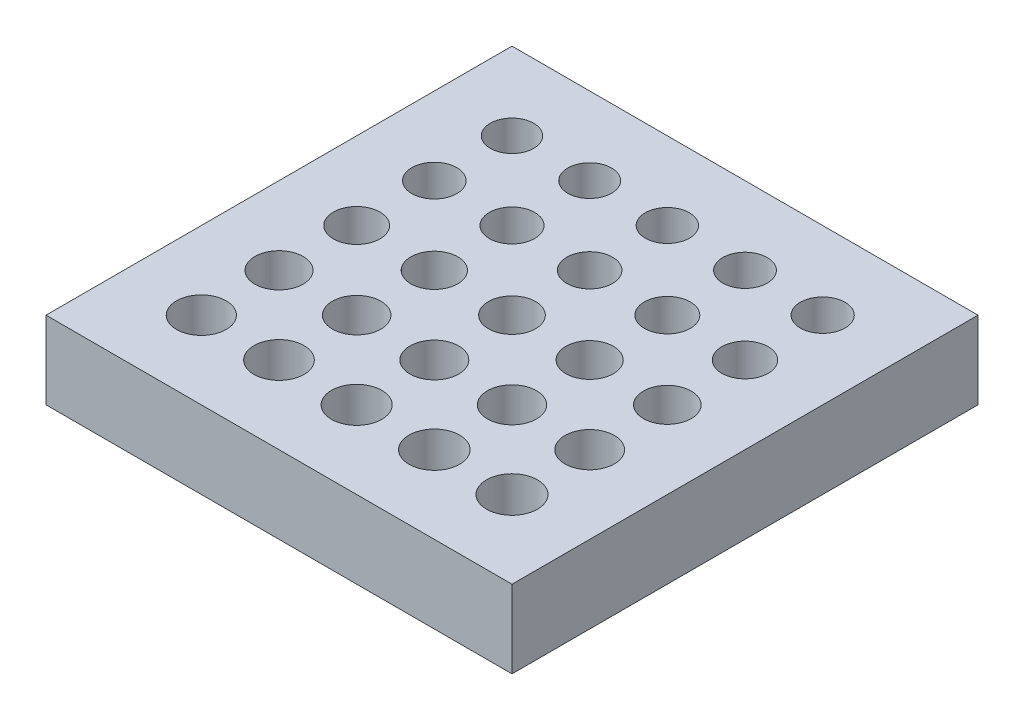
ISO-10303-21;
HEADER;
FILE_DESCRIPTION(('STEP AP214'),'2;1');
FILE_NAME('part.step','',(''),(''),'','','');
FILE_SCHEMA(('AUTOMOTIVE_DESIGN { 1 0 10303 214 1 1 1 1 }'));
ENDSEC;
DATA;
#1=APPLICATION_CONTEXT('core data for automotive mechanical design processes');
#2=APPLICATION_PROTOCOL_DEFINITION('international standard','automotive_design',2000,#1);
#3=PRODUCT_CONTEXT('',#1,'mechanical');
#4=PRODUCT('Part','Part','',(#3));
#5=PRODUCT_RELATED_PRODUCT_CATEGORY('part','',(#4));
#6=PRODUCT_DEFINITION_FORMATION('','',#4);
#7=PRODUCT_DEFINITION_CONTEXT('part definition',#1,'design');
#8=PRODUCT_DEFINITION('design','',#6,#7);
#9=PRODUCT_DEFINITION_SHAPE('','',#8);
#10=(LENGTH_UNIT() NAMED_UNIT(*) SI_UNIT(.MILLI.,.METRE.));
#11=(NAMED_UNIT(*) PLANE_ANGLE_UNIT() SI_UNIT($,.RADIAN.));
#12=(NAMED_UNIT(*) SI_UNIT($,.STERADIAN.) SOLID_ANGLE_UNIT());
#13=UNCERTAINTY_MEASURE_WITH_UNIT(LENGTH_MEASURE(1.E-05),#10,'distance_accuracy_value','');
#14=(GEOMETRIC_REPRESENTATION_CONTEXT(3) GLOBAL_UNCERTAINTY_ASSIGNED_CONTEXT((#13)) GLOBAL_UNIT_ASSIGNED_CONTEXT((#10,
#11,#12)) REPRESENTATION_CONTEXT('',''));
#15=CARTESIAN_POINT('',(0.,0.,0.));
#16=DIRECTION('',(0.,0.,1.));
#17=DIRECTION('',(1.,0.,0.));
#18=AXIS2_PLACEMENT_3D('',#15,#16,#17);
#19=CARTESIAN_POINT('',(0.,6.35,0.));
#20=DIRECTION('',(0.,-1.,0.));
#21=DIRECTION('',(0.,0.,-1.));
#22=AXIS2_PLACEMENT_3D('',#19,#20,#21);
#23=PLANE('',#22);
#24=DIRECTION('',(0.,0.,-1.));
#25=VECTOR('',#24,1.);
#26=CARTESIAN_POINT('',(19.05,6.35,19.05));
#27=LINE('',#26,#25);
#28=CARTESIAN_POINT('',(19.05,6.35,19.05));
#29=VERTEX_POINT('',#28);
#30=CARTESIAN_POINT('',(19.05,6.35,-19.05));
#31=VERTEX_POINT('',#30);
#32=EDGE_CURVE('E89',#29,#31,#27,.T.);
#33=ORIENTED_EDGE('',*,*,#32,.T.);
#34=DIRECTION('',(-1.,0.,0.));
#35=VECTOR('',#34,1.);
#36=CARTESIAN_POINT('',(-19.05,6.35,-19.05));
#37=LINE('',#36,#35);
#38=CARTESIAN_POINT('',(-19.05,6.35,-19.05));
#39=VERTEX_POINT('',#38);
#40=EDGE_CURVE('E84',#31,#39,#37,.T.);
#41=ORIENTED_EDGE('',*,*,#40,.T.);
#42=DIRECTION('',(0.,0.,1.));
#43=VECTOR('',#42,1.);
#44=CARTESIAN_POINT('',(-19.05,6.35,19.05));
#45=LINE('',#44,#43);
#46=CARTESIAN_POINT('',(-19.05,6.35,19.05));
#47=VERTEX_POINT('',#46);
#48=EDGE_CURVE('E87',#39,#47,#45,.T.);
#49=ORIENTED_EDGE('',*,*,#48,.T.);
#50=DIRECTION('',(1.,0.,0.));
#51=VECTOR('',#50,1.);
#52=CARTESIAN_POINT('',(-19.05,6.35,19.05));
#53=LINE('',#52,#51);
#54=EDGE_CURVE('E54',#47,#29,#53,.T.);
#55=ORIENTED_EDGE('',*,*,#54,.T.);
#56=EDGE_LOOP('',(#33,#41,#49,#55));
#57=FACE_BOUND('',#56,.T.);
#58=CARTESIAN_POINT('',(-12.7,6.35,-12.7));
#59=DIRECTION('',(0.,1.,0.));
#60=DIRECTION('',(0.,0.,1.));
#61=AXIS2_PLACEMENT_3D('',#58,#59,#60);
#62=CIRCLE('',#61,1.778);
#63=CARTESIAN_POINT('',(-12.7,6.35,-10.922));
#64=VERTEX_POINT('',#63);
#65=EDGE_CURVE('E104',#64,#64,#62,.T.);
#66=ORIENTED_EDGE('',*,*,#65,.F.);
#67=EDGE_LOOP('',(#66));
#68=FACE_BOUND('',#67,.T.);
#69=CARTESIAN_POINT('',(-6.35,6.35,-12.7));
#70=DIRECTION('',(0.,1.,0.));
#71=DIRECTION('',(0.,0.,1.));
#72=AXIS2_PLACEMENT_3D('',#69,#70,#71);
#73=CIRCLE('',#72,1.7907);
#74=CARTESIAN_POINT('',(-6.35,6.35,-10.9093));
#75=VERTEX_POINT('',#74);
#76=EDGE_CURVE('E119',#75,#75,#73,.T.);
#77=ORIENTED_EDGE('',*,*,#76,.F.);
#78=EDGE_LOOP('',(#77));
#79=FACE_BOUND('',#78,.T.);
#80=CARTESIAN_POINT('',(0.,6.35,-12.7));
#81=DIRECTION('',(0.,1.,0.));
#82=DIRECTION('',(0.,0.,1.));
#83=AXIS2_PLACEMENT_3D('',#80,#81,#82);
#84=CIRCLE('',#83,1.8034);
#85=CARTESIAN_POINT('',(0.,6.35,-10.8966));
#86=VERTEX_POINT('',#85);
#87=EDGE_CURVE('E125',#86,#86,#84,.T.);
#88=ORIENTED_EDGE('',*,*,#87,.F.);
#89=EDGE_LOOP('',(#88));
#90=FACE_BOUND('',#89,.T.);
#91=CARTESIAN_POINT('',(6.35,6.35,-12.7));
#92=DIRECTION('',(0.,1.,0.));
#93=DIRECTION('',(0.,0.,1.));
#94=AXIS2_PLACEMENT_3D('',#91,#92,#93);
#95=CIRCLE('',#94,1.8161);
#96=CARTESIAN_POINT('',(6.35,6.35,-10.8839));
#97=VERTEX_POINT('',#96);
#98=EDGE_CURVE('E131',#97,#97,#95,.T.);
#99=ORIENTED_EDGE('',*,*,#98,.F.);
#100=EDGE_LOOP('',(#99));
#101=FACE_BOUND('',#100,.T.);
#102=CARTESIAN_POINT('',(12.7,6.35,-12.7));
#103=DIRECTION('',(0.,1.,0.));
#104=DIRECTION('',(0.,0.,1.));
#105=AXIS2_PLACEMENT_3D('',#102,#103,#104);
#106=CIRCLE('',#105,1.8288);
#107=CARTESIAN_POINT('',(12.7,6.35,-10.8712));
#108=VERTEX_POINT('',#107);
#109=EDGE_CURVE('E137',#108,#108,#106,.T.);
#110=ORIENTED_EDGE('',*,*,#109,.F.);
#111=EDGE_LOOP('',(#110));
#112=FACE_BOUND('',#111,.T.);
#113=CARTESIAN_POINT('',(-6.35,6.35,-6.35));
#114=DIRECTION('',(0.,1.,0.));
#115=DIRECTION('',(0.,0.,1.));
#116=AXIS2_PLACEMENT_3D('',#113,#114,#115);
#117=CIRCLE('',#116,1.8542);
#118=CARTESIAN_POINT('',(-6.35,6.35,-4.4958));
#119=VERTEX_POINT('',#118);
#120=EDGE_CURVE('E143',#119,#119,#117,.T.);
#121=ORIENTED_EDGE('',*,*,#120,.F.);
#122=EDGE_LOOP('',(#121));
#123=FACE_BOUND('',#122,.T.);
#124=CARTESIAN_POINT('',(0.,6.35,-6.35));
#125=DIRECTION('',(0.,1.,0.));
#126=DIRECTION('',(0.,0.,1.));
#127=AXIS2_PLACEMENT_3D('',#124,#125,#126);
#128=CIRCLE('',#127,1.8669);
#129=CARTESIAN_POINT('',(0.,6.35,-4.4831));
#130=VERTEX_POINT('',#129);
#131=EDGE_CURVE('E149',#130,#130,#128,.T.);
#132=ORIENTED_EDGE('',*,*,#131,.F.);
#133=EDGE_LOOP('',(#132));
#134=FACE_BOUND('',#133,.T.);
#135=CARTESIAN_POINT('',(6.35,6.35,-6.35));
#136=DIRECTION('',(0.,1.,0.));
#137=DIRECTION('',(0.,0.,1.));
#138=AXIS2_PLACEMENT_3D('',#135,#136,#137);
#139=CIRCLE('',#138,1.8796);
#140=CARTESIAN_POINT('',(6.35,6.35,-4.4704));
#141=VERTEX_POINT('',#140);
#142=EDGE_CURVE('E155',#141,#141,#139,.T.);
#143=ORIENTED_EDGE('',*,*,#142,.F.);
#144=EDGE_LOOP('',(#143));
#145=FACE_BOUND('',#144,.T.);
#146=CARTESIAN_POINT('',(12.7,6.35,-6.35));
#147=DIRECTION('',(0.,1.,0.));
#148=DIRECTION('',(0.,0.,1.));
#149=AXIS2_PLACEMENT_3D('',#146,#147,#148);
#150=CIRCLE('',#149,1.8923);
#151=CARTESIAN_POINT('',(12.7,6.35,-4.4577));
#152=VERTEX_POINT('',#151);
#153=EDGE_CURVE('E161',#152,#152,#150,.T.);
#154=ORIENTED_EDGE('',*,*,#153,.F.);
#155=EDGE_LOOP('',(#154));
#156=FACE_BOUND('',#155,.T.);
#157=CARTESIAN_POINT('',(-6.35,6.35,0.));
#158=DIRECTION('',(0.,1.,0.));
#159=DIRECTION('',(0.,0.,1.));
#160=AXIS2_PLACEMENT_3D('',#157,#158,#159);
#161=CIRCLE('',#160,1.9177);
#162=CARTESIAN_POINT('',(-6.35,6.35,1.9177));
#163=VERTEX_POINT('',#162);
#164=EDGE_CURVE('E167',#163,#163,#161,.T.);
#165=ORIENTED_EDGE('',*,*,#164,.F.);
#166=EDGE_LOOP('',(#165));
#167=FACE_BOUND('',#166,.T.);
#168=CARTESIAN_POINT('',(1.30913186300431E-13,6.35,-1.1541030897538E-13));
#169=DIRECTION('',(0.,1.,0.));
#170=DIRECTION('',(0.,0.,1.));
#171=AXIS2_PLACEMENT_3D('',#168,#169,#170);
#172=CIRCLE('',#171,1.9304);
#173=CARTESIAN_POINT('',(1.30913186300431E-13,6.35,1.93039999999988));
#174=VERTEX_POINT('',#173);
#175=EDGE_CURVE('E173',#174,#174,#172,.T.);
#176=ORIENTED_EDGE('',*,*,#175,.F.);
#177=EDGE_LOOP('',(#176));
#178=FACE_BOUND('',#177,.T.);
#179=CARTESIAN_POINT('',(6.35,6.35,0.));
#180=DIRECTION('',(0.,1.,0.));
#181=DIRECTION('',(0.,0.,1.));
#182=AXIS2_PLACEMENT_3D('',#179,#180,#181);
#183=CIRCLE('',#182,1.9431);
#184=CARTESIAN_POINT('',(6.35,6.35,1.9431));
#185=VERTEX_POINT('',#184);
#186=EDGE_CURVE('E179',#185,#185,#183,.T.);
#187=ORIENTED_EDGE('',*,*,#186,.F.);
#188=EDGE_LOOP('',(#187));
#189=FACE_BOUND('',#188,.T.);
#190=CARTESIAN_POINT('',(12.7,6.35,0.));
#191=DIRECTION('',(0.,1.,0.));
#192=DIRECTION('',(0.,0.,1.));
#193=AXIS2_PLACEMENT_3D('',#190,#191,#192);
#194=CIRCLE('',#193,1.9558);
#195=CARTESIAN_POINT('',(12.7,6.35,1.9558));
#196=VERTEX_POINT('',#195);
#197=EDGE_CURVE('E185',#196,#196,#194,.T.);
#198=ORIENTED_EDGE('',*,*,#197,.F.);
#199=EDGE_LOOP('',(#198));
#200=FACE_BOUND('',#199,.T.);
#201=CARTESIAN_POINT('',(-6.35,6.35,6.35));
#202=DIRECTION('',(0.,1.,0.));
#203=DIRECTION('',(0.,0.,1.));
#204=AXIS2_PLACEMENT_3D('',#201,#202,#203);
#205=CIRCLE('',#204,1.9812);
#206=CARTESIAN_POINT('',(-6.35,6.35,8.3312));
#207=VERTEX_POINT('',#206);
#208=EDGE_CURVE('E191',#207,#207,#205,.T.);
#209=ORIENTED_EDGE('',*,*,#208,.F.);
#210=EDGE_LOOP('',(#209));
#211=FACE_BOUND('',#210,.T.);
#212=CARTESIAN_POINT('',(0.,6.35,6.35));
#213=DIRECTION('',(0.,1.,0.));
#214=DIRECTION('',(0.,0.,1.));
#215=AXIS2_PLACEMENT_3D('',#212,#213,#214);
#216=CIRCLE('',#215,1.9939);
#217=CARTESIAN_POINT('',(0.,6.35,8.3439));
#218=VERTEX_POINT('',#217);
#219=EDGE_CURVE('E197',#218,#218,#216,.T.);
#220=ORIENTED_EDGE('',*,*,#219,.F.);
#221=EDGE_LOOP('',(#220));
#222=FACE_BOUND('',#221,.T.);
#223=CARTESIAN_POINT('',(6.35,6.35,6.35));
#224=DIRECTION('',(0.,1.,0.));
#225=DIRECTION('',(0.,0.,1.));
#226=AXIS2_PLACEMENT_3D('',#223,#224,#225);
#227=CIRCLE('',#226,2.0066);
#228=CARTESIAN_POINT('',(6.35,6.35,8.3566));
#229=VERTEX_POINT('',#228);
#230=EDGE_CURVE('E203',#229,#229,#227,.T.);
#231=ORIENTED_EDGE('',*,*,#230,.F.);
#232=EDGE_LOOP('',(#231));
#233=FACE_BOUND('',#232,.T.);
#234=CARTESIAN_POINT('',(12.7,6.35,6.35));
#235=DIRECTION('',(0.,1.,0.));
#236=DIRECTION('',(0.,0.,1.));
#237=AXIS2_PLACEMENT_3D('',#234,#235,#236);
#238=CIRCLE('',#237,2.0193);
#239=CARTESIAN_POINT('',(12.7,6.35,8.3693));
#240=VERTEX_POINT('',#239);
#241=EDGE_CURVE('E209',#240,#240,#238,.T.);
#242=ORIENTED_EDGE('',*,*,#241,.F.);
#243=EDGE_LOOP('',(#242));
#244=FACE_BOUND('',#243,.T.);
#245=CARTESIAN_POINT('',(-6.35,6.35,12.7));
#246=DIRECTION('',(0.,1.,0.));
#247=DIRECTION('',(0.,0.,1.));
#248=AXIS2_PLACEMENT_3D('',#245,#246,#247);
#249=CIRCLE('',#248,2.0447);
#250=CARTESIAN_POINT('',(-6.35,6.35,14.7447));
#251=VERTEX_POINT('',#250);
#252=EDGE_CURVE('E215',#251,#251,#249,.T.);
#253=ORIENTED_EDGE('',*,*,#252,.F.);
#254=EDGE_LOOP('',(#253));
#255=FACE_BOUND('',#254,.T.);
#256=CARTESIAN_POINT('',(0.,6.35,12.7));
#257=DIRECTION('',(0.,1.,0.));
#258=DIRECTION('',(0.,0.,1.));
#259=AXIS2_PLACEMENT_3D('',#256,#257,#258);
#260=CIRCLE('',#259,2.0574);
#261=CARTESIAN_POINT('',(0.,6.35,14.7574));
#262=VERTEX_POINT('',#261);
#263=EDGE_CURVE('E221',#262,#262,#260,.T.);
#264=ORIENTED_EDGE('',*,*,#263,.F.);
#265=EDGE_LOOP('',(#264));
#266=FACE_BOUND('',#265,.T.);
#267=CARTESIAN_POINT('',(6.35,6.35,12.7));
#268=DIRECTION('',(0.,1.,0.));
#269=DIRECTION('',(0.,0.,1.));
#270=AXIS2_PLACEMENT_3D('',#267,#268,#269);
#271=CIRCLE('',#270,2.0701);
#272=CARTESIAN_POINT('',(6.35,6.35,14.7701));
#273=VERTEX_POINT('',#272);
#274=EDGE_CURVE('E227',#273,#273,#271,.T.);
#275=ORIENTED_EDGE('',*,*,#274,.F.);
#276=EDGE_LOOP('',(#275));
#277=FACE_BOUND('',#276,.T.);
#278=CARTESIAN_POINT('',(12.7,6.35,12.7));
#279=DIRECTION('',(0.,1.,0.));
#280=DIRECTION('',(0.,0.,1.));
#281=AXIS2_PLACEMENT_3D('',#278,#279,#280);
#282=CIRCLE('',#281,2.0828);
#283=CARTESIAN_POINT('',(12.7,6.35,14.7828));
#284=VERTEX_POINT('',#283);
#285=EDGE_CURVE('E233',#284,#284,#282,.T.);
#286=ORIENTED_EDGE('',*,*,#285,.F.);
#287=EDGE_LOOP('',(#286));
#288=FACE_BOUND('',#287,.T.);
#289=CARTESIAN_POINT('',(-12.7,6.35,-6.35));
#290=DIRECTION('',(0.,1.,0.));
#291=DIRECTION('',(0.,0.,1.));
#292=AXIS2_PLACEMENT_3D('',#289,#290,#291);
#293=CIRCLE('',#292,1.8415);
#294=CARTESIAN_POINT('',(-12.7,6.35,-4.5085));
#295=VERTEX_POINT('',#294);
#296=EDGE_CURVE('E239',#295,#295,#293,.T.);
#297=ORIENTED_EDGE('',*,*,#296,.F.);
#298=EDGE_LOOP('',(#297));
#299=FACE_BOUND('',#298,.T.);
#300=CARTESIAN_POINT('',(-12.7,6.35,0.));
#301=DIRECTION('',(0.,1.,0.));
#302=DIRECTION('',(0.,0.,1.));
#303=AXIS2_PLACEMENT_3D('',#300,#301,#302);
#304=CIRCLE('',#303,1.905);
#305=CARTESIAN_POINT('',(-12.7,6.35,1.905));
#306=VERTEX_POINT('',#305);
#307=EDGE_CURVE('E245',#306,#306,#304,.T.);
#308=ORIENTED_EDGE('',*,*,#307,.F.);
#309=EDGE_LOOP('',(#308));
#310=FACE_BOUND('',#309,.T.);
#311=CARTESIAN_POINT('',(-12.7,6.35,6.35));
#312=DIRECTION('',(0.,1.,0.));
#313=DIRECTION('',(0.,0.,1.));
#314=AXIS2_PLACEMENT_3D('',#311,#312,#313);
#315=CIRCLE('',#314,1.9685);
#316=CARTESIAN_POINT('',(-12.7,6.35,8.3185));
#317=VERTEX_POINT('',#316);
#318=EDGE_CURVE('E251',#317,#317,#315,.T.);
#319=ORIENTED_EDGE('',*,*,#318,.F.);
#320=EDGE_LOOP('',(#319));
#321=FACE_BOUND('',#320,.T.);
#322=CARTESIAN_POINT('',(-12.7,6.35,12.7));
#323=DIRECTION('',(0.,1.,0.));
#324=DIRECTION('',(0.,0.,1.));
#325=AXIS2_PLACEMENT_3D('',#322,#323,#324);
#326=CIRCLE('',#325,2.032);
#327=CARTESIAN_POINT('',(-12.7,6.35,14.732));
#328=VERTEX_POINT('',#327);
#329=EDGE_CURVE('E257',#328,#328,#326,.T.);
#330=ORIENTED_EDGE('',*,*,#329,.F.);
#331=EDGE_LOOP('',(#330));
#332=FACE_BOUND('',#331,.T.);
#333=ADVANCED_FACE('F37',(#57,#68,#79,#90,#101,#112,#123,#134,#145,#156,#167,#178,#189,#200,
#211,#222,#233,#244,#255,#266,#277,#288,#299,#310,#321,#332),#23,.F.);
#334=CARTESIAN_POINT('',(0.,0.,0.));
#335=DIRECTION('',(0.,-1.,0.));
#336=DIRECTION('',(0.,0.,-1.));
#337=AXIS2_PLACEMENT_3D('',#334,#335,#336);
#338=PLANE('',#337);
#339=CARTESIAN_POINT('',(-12.7,0.,6.35));
#340=DIRECTION('',(0.,1.,0.));
#341=DIRECTION('',(0.,0.,1.));
#342=AXIS2_PLACEMENT_3D('',#339,#340,#341);
#343=CIRCLE('',#342,1.9685);
#344=CARTESIAN_POINT('',(-12.7,0.,8.3185));
#345=VERTEX_POINT('',#344);
#346=EDGE_CURVE('E254',#345,#345,#343,.T.);
#347=ORIENTED_EDGE('',*,*,#346,.T.);
#348=EDGE_LOOP('',(#347));
#349=FACE_BOUND('',#348,.T.);
#350=CARTESIAN_POINT('',(-12.7,0.,-6.35));
#351=DIRECTION('',(0.,1.,0.));
#352=DIRECTION('',(0.,0.,1.));
#353=AXIS2_PLACEMENT_3D('',#350,#351,#352);
#354=CIRCLE('',#353,1.8415);
#355=CARTESIAN_POINT('',(-12.7,0.,-4.5085));
#356=VERTEX_POINT('',#355);
#357=EDGE_CURVE('E242',#356,#356,#354,.T.);
#358=ORIENTED_EDGE('',*,*,#357,.T.);
#359=EDGE_LOOP('',(#358));
#360=FACE_BOUND('',#359,.T.);
#361=CARTESIAN_POINT('',(6.35,0.,12.7));
#362=DIRECTION('',(0.,1.,0.));
#363=DIRECTION('',(0.,0.,1.));
#364=AXIS2_PLACEMENT_3D('',#361,#362,#363);
#365=CIRCLE('',#364,2.0701);
#366=CARTESIAN_POINT('',(6.35,0.,14.7701));
#367=VERTEX_POINT('',#366);
#368=EDGE_CURVE('E230',#367,#367,#365,.T.);
#369=ORIENTED_EDGE('',*,*,#368,.T.);
#370=EDGE_LOOP('',(#369));
#371=FACE_BOUND('',#370,.T.);
#372=CARTESIAN_POINT('',(-6.35,0.,12.7));
#373=DIRECTION('',(0.,1.,0.));
#374=DIRECTION('',(0.,0.,1.));
#375=AXIS2_PLACEMENT_3D('',#372,#373,#374);
#376=CIRCLE('',#375,2.0447);
#377=CARTESIAN_POINT('',(-6.35,0.,14.7447));
#378=VERTEX_POINT('',#377);
#379=EDGE_CURVE('E218',#378,#378,#376,.T.);
#380=ORIENTED_EDGE('',*,*,#379,.T.);
#381=EDGE_LOOP('',(#380));
#382=FACE_BOUND('',#381,.T.);
#383=CARTESIAN_POINT('',(6.35,0.,6.35));
#384=DIRECTION('',(0.,1.,0.));
#385=DIRECTION('',(0.,0.,1.));
#386=AXIS2_PLACEMENT_3D('',#383,#384,#385);
#387=CIRCLE('',#386,2.0066);
#388=CARTESIAN_POINT('',(6.35,0.,8.3566));
#389=VERTEX_POINT('',#388);
#390=EDGE_CURVE('E206',#389,#389,#387,.T.);
#391=ORIENTED_EDGE('',*,*,#390,.T.);
#392=EDGE_LOOP('',(#391));
#393=FACE_BOUND('',#392,.T.);
#394=CARTESIAN_POINT('',(-6.35,0.,6.35));
#395=DIRECTION('',(0.,1.,0.));
#396=DIRECTION('',(0.,0.,1.));
#397=AXIS2_PLACEMENT_3D('',#394,#395,#396);
#398=CIRCLE('',#397,1.9812);
#399=CARTESIAN_POINT('',(-6.35,0.,8.3312));
#400=VERTEX_POINT('',#399);
#401=EDGE_CURVE('E194',#400,#400,#398,.T.);
#402=ORIENTED_EDGE('',*,*,#401,.T.);
#403=EDGE_LOOP('',(#402));
#404=FACE_BOUND('',#403,.T.);
#405=CARTESIAN_POINT('',(6.35,0.,0.));
#406=DIRECTION('',(0.,1.,0.));
#407=DIRECTION('',(0.,0.,1.));
#408=AXIS2_PLACEMENT_3D('',#405,#406,#407);
#409=CIRCLE('',#408,1.9431);
#410=CARTESIAN_POINT('',(6.35,0.,1.9431));
#411=VERTEX_POINT('',#410);
#412=EDGE_CURVE('E182',#411,#411,#409,.T.);
#413=ORIENTED_EDGE('',*,*,#412,.T.);
#414=EDGE_LOOP('',(#413));
#415=FACE_BOUND('',#414,.T.);
#416=CARTESIAN_POINT('',(-6.35,0.,0.));
#417=DIRECTION('',(0.,1.,0.));
#418=DIRECTION('',(0.,0.,1.));
#419=AXIS2_PLACEMENT_3D('',#416,#417,#418);
#420=CIRCLE('',#419,1.9177);
#421=CARTESIAN_POINT('',(-6.35,0.,1.9177));
#422=VERTEX_POINT('',#421);
#423=EDGE_CURVE('E170',#422,#422,#420,.T.);
#424=ORIENTED_EDGE('',*,*,#423,.T.);
#425=EDGE_LOOP('',(#424));
#426=FACE_BOUND('',#425,.T.);
#427=CARTESIAN_POINT('',(6.35,0.,-6.35));
#428=DIRECTION('',(0.,1.,0.));
#429=DIRECTION('',(0.,0.,1.));
#430=AXIS2_PLACEMENT_3D('',#427,#428,#429);
#431=CIRCLE('',#430,1.8796);
#432=CARTESIAN_POINT('',(6.35,0.,-4.4704));
#433=VERTEX_POINT('',#432);
#434=EDGE_CURVE('E158',#433,#433,#431,.T.);
#435=ORIENTED_EDGE('',*,*,#434,.T.);
#436=EDGE_LOOP('',(#435));
#437=FACE_BOUND('',#436,.T.);
#438=CARTESIAN_POINT('',(-6.35,0.,-6.35));
#439=DIRECTION('',(0.,1.,0.));
#440=DIRECTION('',(0.,0.,1.));
#441=AXIS2_PLACEMENT_3D('',#438,#439,#440);
#442=CIRCLE('',#441,1.8542);
#443=CARTESIAN_POINT('',(-6.35,0.,-4.4958));
#444=VERTEX_POINT('',#443);
#445=EDGE_CURVE('E146',#444,#444,#442,.T.);
#446=ORIENTED_EDGE('',*,*,#445,.T.);
#447=EDGE_LOOP('',(#446));
#448=FACE_BOUND('',#447,.T.);
#449=CARTESIAN_POINT('',(6.35,0.,-12.7));
#450=DIRECTION('',(0.,1.,0.));
#451=DIRECTION('',(0.,0.,1.));
#452=AXIS2_PLACEMENT_3D('',#449,#450,#451);
#453=CIRCLE('',#452,1.8161);
#454=CARTESIAN_POINT('',(6.35,0.,-10.8839));
#455=VERTEX_POINT('',#454);
#456=EDGE_CURVE('E134',#455,#455,#453,.T.);
#457=ORIENTED_EDGE('',*,*,#456,.T.);
#458=EDGE_LOOP('',(#457));
#459=FACE_BOUND('',#458,.T.);
#460=CARTESIAN_POINT('',(-6.35,0.,-12.7));
#461=DIRECTION('',(0.,1.,0.));
#462=DIRECTION('',(0.,0.,1.));
#463=AXIS2_PLACEMENT_3D('',#460,#461,#462);
#464=CIRCLE('',#463,1.7907);
#465=CARTESIAN_POINT('',(-6.35,0.,-10.9093));
#466=VERTEX_POINT('',#465);
#467=EDGE_CURVE('E122',#466,#466,#464,.T.);
#468=ORIENTED_EDGE('',*,*,#467,.T.);
#469=EDGE_LOOP('',(#468));
#470=FACE_BOUND('',#469,.T.);
#471=DIRECTION('',(0.,0.,-1.));
#472=VECTOR('',#471,1.);
#473=CARTESIAN_POINT('',(19.05,0.,19.05));
#474=LINE('',#473,#472);
#475=CARTESIAN_POINT('',(19.05,0.,19.05));
#476=VERTEX_POINT('',#475);
#477=CARTESIAN_POINT('',(19.05,0.,-19.05));
#478=VERTEX_POINT('',#477);
#479=EDGE_CURVE('E101',#476,#478,#474,.T.);
#480=ORIENTED_EDGE('',*,*,#479,.F.);
#481=DIRECTION('',(1.,0.,0.));
#482=VECTOR('',#481,1.);
#483=CARTESIAN_POINT('',(-19.05,0.,19.05));
#484=LINE('',#483,#482);
#485=CARTESIAN_POINT('',(-19.05,0.,19.05));
#486=VERTEX_POINT('',#485);
#487=EDGE_CURVE('E77',#486,#476,#484,.T.);
#488=ORIENTED_EDGE('',*,*,#487,.F.);
#489=DIRECTION('',(0.,0.,1.));
#490=VECTOR('',#489,1.);
#491=CARTESIAN_POINT('',(-19.05,0.,19.05));
#492=LINE('',#491,#490);
#493=CARTESIAN_POINT('',(-19.05,0.,-19.05));
#494=VERTEX_POINT('',#493);
#495=EDGE_CURVE('E71',#494,#486,#492,.T.);
#496=ORIENTED_EDGE('',*,*,#495,.F.);
#497=DIRECTION('',(-1.,0.,0.));
#498=VECTOR('',#497,1.);
#499=CARTESIAN_POINT('',(-19.05,0.,-19.05));
#500=LINE('',#499,#498);
#501=EDGE_CURVE('E93',#478,#494,#500,.T.);
#502=ORIENTED_EDGE('',*,*,#501,.F.);
#503=EDGE_LOOP('',(#480,#488,#496,#502));
#504=FACE_BOUND('',#503,.T.);
#505=CARTESIAN_POINT('',(-12.7,0.,-12.7));
#506=DIRECTION('',(0.,1.,0.));
#507=DIRECTION('',(0.,0.,1.));
#508=AXIS2_PLACEMENT_3D('',#505,#506,#507);
#509=CIRCLE('',#508,1.778);
#510=CARTESIAN_POINT('',(-12.7,0.,-10.922));
#511=VERTEX_POINT('',#510);
#512=EDGE_CURVE('E116',#511,#511,#509,.T.);
#513=ORIENTED_EDGE('',*,*,#512,.T.);
#514=EDGE_LOOP('',(#513));
#515=FACE_BOUND('',#514,.T.);
#516=CARTESIAN_POINT('',(0.,0.,-12.7));
#517=DIRECTION('',(0.,1.,0.));
#518=DIRECTION('',(0.,0.,1.));
#519=AXIS2_PLACEMENT_3D('',#516,#517,#518);
#520=CIRCLE('',#519,1.8034);
#521=CARTESIAN_POINT('',(0.,0.,-10.8966));
#522=VERTEX_POINT('',#521);
#523=EDGE_CURVE('E128',#522,#522,#520,.T.);
#524=ORIENTED_EDGE('',*,*,#523,.T.);
#525=EDGE_LOOP('',(#524));
#526=FACE_BOUND('',#525,.T.);
#527=CARTESIAN_POINT('',(12.7,0.,-12.7));
#528=DIRECTION('',(0.,1.,0.));
#529=DIRECTION('',(0.,0.,1.));
#530=AXIS2_PLACEMENT_3D('',#527,#528,#529);
#531=CIRCLE('',#530,1.8288);
#532=CARTESIAN_POINT('',(12.7,0.,-10.8712));
#533=VERTEX_POINT('',#532);
#534=EDGE_CURVE('E140',#533,#533,#531,.T.);
#535=ORIENTED_EDGE('',*,*,#534,.T.);
#536=EDGE_LOOP('',(#535));
#537=FACE_BOUND('',#536,.T.);
#538=CARTESIAN_POINT('',(0.,0.,-6.35));
#539=DIRECTION('',(0.,1.,0.));
#540=DIRECTION('',(0.,0.,1.));
#541=AXIS2_PLACEMENT_3D('',#538,#539,#540);
#542=CIRCLE('',#541,1.8669);
#543=CARTESIAN_POINT('',(0.,0.,-4.4831));
#544=VERTEX_POINT('',#543);
#545=EDGE_CURVE('E152',#544,#544,#542,.T.);
#546=ORIENTED_EDGE('',*,*,#545,.T.);
#547=EDGE_LOOP('',(#546));
#548=FACE_BOUND('',#547,.T.);
#549=CARTESIAN_POINT('',(12.7,0.,-6.35));
#550=DIRECTION('',(0.,1.,0.));
#551=DIRECTION('',(0.,0.,1.));
#552=AXIS2_PLACEMENT_3D('',#549,#550,#551);
#553=CIRCLE('',#552,1.8923);
#554=CARTESIAN_POINT('',(12.7,0.,-4.4577));
#555=VERTEX_POINT('',#554);
#556=EDGE_CURVE('E164',#555,#555,#553,.T.);
#557=ORIENTED_EDGE('',*,*,#556,.T.);
#558=EDGE_LOOP('',(#557));
#559=FACE_BOUND('',#558,.T.);
#560=CARTESIAN_POINT('',(1.30913186300431E-13,0.,-1.1541030897538E-13));
#561=DIRECTION('',(0.,1.,0.));
#562=DIRECTION('',(0.,0.,1.));
#563=AXIS2_PLACEMENT_3D('',#560,#561,#562);
#564=CIRCLE('',#563,1.9304);
#565=CARTESIAN_POINT('',(1.30913186300431E-13,0.,1.93039999999988));
#566=VERTEX_POINT('',#565);
#567=EDGE_CURVE('E176',#566,#566,#564,.T.);
#568=ORIENTED_EDGE('',*,*,#567,.T.);
#569=EDGE_LOOP('',(#568));
#570=FACE_BOUND('',#569,.T.);
#571=CARTESIAN_POINT('',(12.7,0.,0.));
#572=DIRECTION('',(0.,1.,0.));
#573=DIRECTION('',(0.,0.,1.));
#574=AXIS2_PLACEMENT_3D('',#571,#572,#573);
#575=CIRCLE('',#574,1.9558);
#576=CARTESIAN_POINT('',(12.7,0.,1.9558));
#577=VERTEX_POINT('',#576);
#578=EDGE_CURVE('E188',#577,#577,#575,.T.);
#579=ORIENTED_EDGE('',*,*,#578,.T.);
#580=EDGE_LOOP('',(#579));
#581=FACE_BOUND('',#580,.T.);
#582=CARTESIAN_POINT('',(0.,0.,6.35));
#583=DIRECTION('',(0.,1.,0.));
#584=DIRECTION('',(0.,0.,1.));
#585=AXIS2_PLACEMENT_3D('',#582,#583,#584);
#586=CIRCLE('',#585,1.9939);
#587=CARTESIAN_POINT('',(0.,0.,8.3439));
#588=VERTEX_POINT('',#587);
#589=EDGE_CURVE('E200',#588,#588,#586,.T.);
#590=ORIENTED_EDGE('',*,*,#589,.T.);
#591=EDGE_LOOP('',(#590));
#592=FACE_BOUND('',#591,.T.);
#593=CARTESIAN_POINT('',(12.7,0.,6.35));
#594=DIRECTION('',(0.,1.,0.));
#595=DIRECTION('',(0.,0.,1.));
#596=AXIS2_PLACEMENT_3D('',#593,#594,#595);
#597=CIRCLE('',#596,2.0193);
#598=CARTESIAN_POINT('',(12.7,0.,8.3693));
#599=VERTEX_POINT('',#598);
#600=EDGE_CURVE('E212',#599,#599,#597,.T.);
#601=ORIENTED_EDGE('',*,*,#600,.T.);
#602=EDGE_LOOP('',(#601));
#603=FACE_BOUND('',#602,.T.);
#604=CARTESIAN_POINT('',(0.,0.,12.7));
#605=DIRECTION('',(0.,1.,0.));
#606=DIRECTION('',(0.,0.,1.));
#607=AXIS2_PLACEMENT_3D('',#604,#605,#606);
#608=CIRCLE('',#607,2.0574);
#609=CARTESIAN_POINT('',(0.,0.,14.7574));
#610=VERTEX_POINT('',#609);
#611=EDGE_CURVE('E224',#610,#610,#608,.T.);
#612=ORIENTED_EDGE('',*,*,#611,.T.);
#613=EDGE_LOOP('',(#612));
#614=FACE_BOUND('',#613,.T.);
#615=CARTESIAN_POINT('',(12.7,0.,12.7));
#616=DIRECTION('',(0.,1.,0.));
#617=DIRECTION('',(0.,0.,1.));
#618=AXIS2_PLACEMENT_3D('',#615,#616,#617);
#619=CIRCLE('',#618,2.0828);
#620=CARTESIAN_POINT('',(12.7,0.,14.7828));
#621=VERTEX_POINT('',#620);
#622=EDGE_CURVE('E236',#621,#621,#619,.T.);
#623=ORIENTED_EDGE('',*,*,#622,.T.);
#624=EDGE_LOOP('',(#623));
#625=FACE_BOUND('',#624,.T.);
#626=CARTESIAN_POINT('',(-12.7,0.,0.));
#627=DIRECTION('',(0.,1.,0.));
#628=DIRECTION('',(0.,0.,1.));
#629=AXIS2_PLACEMENT_3D('',#626,#627,#628);
#630=CIRCLE('',#629,1.905);
#631=CARTESIAN_POINT('',(-12.7,0.,1.905));
#632=VERTEX_POINT('',#631);
#633=EDGE_CURVE('E248',#632,#632,#630,.T.);
#634=ORIENTED_EDGE('',*,*,#633,.T.);
#635=EDGE_LOOP('',(#634));
#636=FACE_BOUND('',#635,.T.);
#637=CARTESIAN_POINT('',(-12.7,0.,12.7));
#638=DIRECTION('',(0.,1.,0.));
#639=DIRECTION('',(0.,0.,1.));
#640=AXIS2_PLACEMENT_3D('',#637,#638,#639);
#641=CIRCLE('',#640,2.032);
#642=CARTESIAN_POINT('',(-12.7,0.,14.732));
#643=VERTEX_POINT('',#642);
#644=EDGE_CURVE('E260',#643,#643,#641,.T.);
#645=ORIENTED_EDGE('',*,*,#644,.T.);
#646=EDGE_LOOP('',(#645));
#647=FACE_BOUND('',#646,.T.);
#648=ADVANCED_FACE('F112',(#349,#360,#371,#382,#393,#404,#415,#426,#437,#448,#459,#470,#504,
#515,#526,#537,#548,#559,#570,#581,#592,#603,#614,#625,#636,#647),#338,.T.);
#649=CARTESIAN_POINT('',(19.05,6.35,19.05));
#650=DIRECTION('',(-1.,0.,0.));
#651=DIRECTION('',(0.,0.,1.));
#652=AXIS2_PLACEMENT_3D('',#649,#650,#651);
#653=PLANE('',#652);
#654=ORIENTED_EDGE('',*,*,#479,.T.);
#655=DIRECTION('',(0.,-1.,0.));
#656=VECTOR('',#655,1.);
#657=CARTESIAN_POINT('',(19.05,6.35,-19.05));
#658=LINE('',#657,#656);
#659=EDGE_CURVE('E11',#31,#478,#658,.T.);
#660=ORIENTED_EDGE('',*,*,#659,.F.);
#661=ORIENTED_EDGE('',*,*,#32,.F.);
#662=DIRECTION('',(0.,-1.,0.));
#663=VECTOR('',#662,1.);
#664=CARTESIAN_POINT('',(19.05,6.35,19.05));
#665=LINE('',#664,#663);
#666=EDGE_CURVE('E97',#29,#476,#665,.T.);
#667=ORIENTED_EDGE('',*,*,#666,.T.);
#668=EDGE_LOOP('',(#654,#660,#661,#667));
#669=FACE_BOUND('',#668,.T.);
#670=ADVANCED_FACE('F39',(#669),#653,.F.);
#671=CARTESIAN_POINT('',(-19.05,6.35,-19.05));
#672=DIRECTION('',(0.,0.,1.));
#673=DIRECTION('',(1.,0.,0.));
#674=AXIS2_PLACEMENT_3D('',#671,#672,#673);
#675=PLANE('',#674);
#676=ORIENTED_EDGE('',*,*,#501,.T.);
#677=DIRECTION('',(0.,-1.,0.));
#678=VECTOR('',#677,1.);
#679=CARTESIAN_POINT('',(-19.05,6.35,-19.05));
#680=LINE('',#679,#678);
#681=EDGE_CURVE('E46',#39,#494,#680,.T.);
#682=ORIENTED_EDGE('',*,*,#681,.F.);
#683=ORIENTED_EDGE('',*,*,#40,.F.);
#684=ORIENTED_EDGE('',*,*,#659,.T.);
#685=EDGE_LOOP('',(#676,#682,#683,#684));
#686=FACE_BOUND('',#685,.T.);
#687=ADVANCED_FACE('F92',(#686),#675,.F.);
#688=CARTESIAN_POINT('',(-19.05,6.35,19.05));
#689=DIRECTION('',(1.,0.,0.));
#690=DIRECTION('',(0.,0.,-1.));
#691=AXIS2_PLACEMENT_3D('',#688,#689,#690);
#692=PLANE('',#691);
#693=ORIENTED_EDGE('',*,*,#495,.T.);
#694=DIRECTION('',(0.,-1.,0.));
#695=VECTOR('',#694,1.);
#696=CARTESIAN_POINT('',(-19.05,6.35,19.05));
#697=LINE('',#696,#695);
#698=EDGE_CURVE('E94',#47,#486,#697,.T.);
#699=ORIENTED_EDGE('',*,*,#698,.F.);
#700=ORIENTED_EDGE('',*,*,#48,.F.);
#701=ORIENTED_EDGE('',*,*,#681,.T.);
#702=EDGE_LOOP('',(#693,#699,#700,#701));
#703=FACE_BOUND('',#702,.T.);
#704=ADVANCED_FACE('F95',(#703),#692,.F.);
#705=CARTESIAN_POINT('',(-19.05,6.35,19.05));
#706=DIRECTION('',(0.,0.,-1.));
#707=DIRECTION('',(-1.,0.,0.));
#708=AXIS2_PLACEMENT_3D('',#705,#706,#707);
#709=PLANE('',#708);
#710=ORIENTED_EDGE('',*,*,#487,.T.);
#711=ORIENTED_EDGE('',*,*,#666,.F.);
#712=ORIENTED_EDGE('',*,*,#54,.F.);
#713=ORIENTED_EDGE('',*,*,#698,.T.);
#714=EDGE_LOOP('',(#710,#711,#712,#713));
#715=FACE_BOUND('',#714,.T.);
#716=ADVANCED_FACE('F109',(#715),#709,.F.);
#717=CARTESIAN_POINT('',(-12.7,6.35,-12.7));
#718=DIRECTION('',(0.,-1.,0.));
#719=DIRECTION('',(0.,0.,-1.));
#720=AXIS2_PLACEMENT_3D('',#717,#718,#719);
#721=CYLINDRICAL_SURFACE('',#720,1.778);
#722=ORIENTED_EDGE('',*,*,#65,.T.);
#723=EDGE_LOOP('',(#722));
#724=FACE_BOUND('',#723,.T.);
#725=ORIENTED_EDGE('',*,*,#512,.F.);
#726=EDGE_LOOP('',(#725));
#727=FACE_BOUND('',#726,.T.);
#728=ADVANCED_FACE('F277',(#724,#727),#721,.F.);
#729=CARTESIAN_POINT('',(-6.35,6.35,-12.7));
#730=DIRECTION('',(0.,-1.,0.));
#731=DIRECTION('',(0.,0.,-1.));
#732=AXIS2_PLACEMENT_3D('',#729,#730,#731);
#733=CYLINDRICAL_SURFACE('',#732,1.7907);
#734=ORIENTED_EDGE('',*,*,#76,.T.);
#735=EDGE_LOOP('',(#734));
#736=FACE_BOUND('',#735,.T.);
#737=ORIENTED_EDGE('',*,*,#467,.F.);
#738=EDGE_LOOP('',(#737));
#739=FACE_BOUND('',#738,.T.);
#740=ADVANCED_FACE('F331',(#736,#739),#733,.F.);
#741=CARTESIAN_POINT('',(0.,6.35,-12.7));
#742=DIRECTION('',(0.,-1.,0.));
#743=DIRECTION('',(0.,0.,-1.));
#744=AXIS2_PLACEMENT_3D('',#741,#742,#743);
#745=CYLINDRICAL_SURFACE('',#744,1.8034);
#746=ORIENTED_EDGE('',*,*,#87,.T.);
#747=EDGE_LOOP('',(#746));
#748=FACE_BOUND('',#747,.T.);
#749=ORIENTED_EDGE('',*,*,#523,.F.);
#750=EDGE_LOOP('',(#749));
#751=FACE_BOUND('',#750,.T.);
#752=ADVANCED_FACE('F340',(#748,#751),#745,.F.);
#753=CARTESIAN_POINT('',(6.35,6.35,-12.7));
#754=DIRECTION('',(0.,-1.,0.));
#755=DIRECTION('',(0.,0.,-1.));
#756=AXIS2_PLACEMENT_3D('',#753,#754,#755);
#757=CYLINDRICAL_SURFACE('',#756,1.8161);
#758=ORIENTED_EDGE('',*,*,#98,.T.);
#759=EDGE_LOOP('',(#758));
#760=FACE_BOUND('',#759,.T.);
#761=ORIENTED_EDGE('',*,*,#456,.F.);
#762=EDGE_LOOP('',(#761));
#763=FACE_BOUND('',#762,.T.);
#764=ADVANCED_FACE('F349',(#760,#763),#757,.F.);
#765=CARTESIAN_POINT('',(12.7,6.35,-12.7));
#766=DIRECTION('',(0.,-1.,0.));
#767=DIRECTION('',(0.,0.,-1.));
#768=AXIS2_PLACEMENT_3D('',#765,#766,#767);
#769=CYLINDRICAL_SURFACE('',#768,1.8288);
#770=ORIENTED_EDGE('',*,*,#109,.T.);
#771=EDGE_LOOP('',(#770));
#772=FACE_BOUND('',#771,.T.);
#773=ORIENTED_EDGE('',*,*,#534,.F.);
#774=EDGE_LOOP('',(#773));
#775=FACE_BOUND('',#774,.T.);
#776=ADVANCED_FACE('F359',(#772,#775),#769,.F.);
#777=CARTESIAN_POINT('',(-6.35,6.35,-6.35));
#778=DIRECTION('',(0.,-1.,0.));
#779=DIRECTION('',(0.,0.,-1.));
#780=AXIS2_PLACEMENT_3D('',#777,#778,#779);
#781=CYLINDRICAL_SURFACE('',#780,1.8542);
#782=ORIENTED_EDGE('',*,*,#120,.T.);
#783=EDGE_LOOP('',(#782));
#784=FACE_BOUND('',#783,.T.);
#785=ORIENTED_EDGE('',*,*,#445,.F.);
#786=EDGE_LOOP('',(#785));
#787=FACE_BOUND('',#786,.T.);
#788=ADVANCED_FACE('F369',(#784,#787),#781,.F.);
#789=CARTESIAN_POINT('',(0.,6.35,-6.35));
#790=DIRECTION('',(0.,-1.,0.));
#791=DIRECTION('',(0.,0.,-1.));
#792=AXIS2_PLACEMENT_3D('',#789,#790,#791);
#793=CYLINDRICAL_SURFACE('',#792,1.8669);
#794=ORIENTED_EDGE('',*,*,#131,.T.);
#795=EDGE_LOOP('',(#794));
#796=FACE_BOUND('',#795,.T.);
#797=ORIENTED_EDGE('',*,*,#545,.F.);
#798=EDGE_LOOP('',(#797));
#799=FACE_BOUND('',#798,.T.);
#800=ADVANCED_FACE('F379',(#796,#799),#793,.F.);
#801=CARTESIAN_POINT('',(6.35,6.35,-6.35));
#802=DIRECTION('',(0.,-1.,0.));
#803=DIRECTION('',(0.,0.,-1.));
#804=AXIS2_PLACEMENT_3D('',#801,#802,#803);
#805=CYLINDRICAL_SURFACE('',#804,1.8796);
#806=ORIENTED_EDGE('',*,*,#142,.T.);
#807=EDGE_LOOP('',(#806));
#808=FACE_BOUND('',#807,.T.);
#809=ORIENTED_EDGE('',*,*,#434,.F.);
#810=EDGE_LOOP('',(#809));
#811=FACE_BOUND('',#810,.T.);
#812=ADVANCED_FACE('F389',(#808,#811),#805,.F.);
#813=CARTESIAN_POINT('',(12.7,6.35,-6.35));
#814=DIRECTION('',(0.,-1.,0.));
#815=DIRECTION('',(0.,0.,-1.));
#816=AXIS2_PLACEMENT_3D('',#813,#814,#815);
#817=CYLINDRICAL_SURFACE('',#816,1.8923);
#818=ORIENTED_EDGE('',*,*,#153,.T.);
#819=EDGE_LOOP('',(#818));
#820=FACE_BOUND('',#819,.T.);
#821=ORIENTED_EDGE('',*,*,#556,.F.);
#822=EDGE_LOOP('',(#821));
#823=FACE_BOUND('',#822,.T.);
#824=ADVANCED_FACE('F399',(#820,#823),#817,.F.);
#825=CARTESIAN_POINT('',(-6.35,6.35,0.));
#826=DIRECTION('',(0.,-1.,0.));
#827=DIRECTION('',(0.,0.,-1.));
#828=AXIS2_PLACEMENT_3D('',#825,#826,#827);
#829=CYLINDRICAL_SURFACE('',#828,1.9177);
#830=ORIENTED_EDGE('',*,*,#164,.T.);
#831=EDGE_LOOP('',(#830));
#832=FACE_BOUND('',#831,.T.);
#833=ORIENTED_EDGE('',*,*,#423,.F.);
#834=EDGE_LOOP('',(#833));
#835=FACE_BOUND('',#834,.T.);
#836=ADVANCED_FACE('F409',(#832,#835),#829,.F.);
#837=CARTESIAN_POINT('',(1.30913186300431E-13,6.35,-1.1541030897538E-13));
#838=DIRECTION('',(0.,-1.,0.));
#839=DIRECTION('',(0.,0.,-1.));
#840=AXIS2_PLACEMENT_3D('',#837,#838,#839);
#841=CYLINDRICAL_SURFACE('',#840,1.9304);
#842=ORIENTED_EDGE('',*,*,#175,.T.);
#843=EDGE_LOOP('',(#842));
#844=FACE_BOUND('',#843,.T.);
#845=ORIENTED_EDGE('',*,*,#567,.F.);
#846=EDGE_LOOP('',(#845));
#847=FACE_BOUND('',#846,.T.);
#848=ADVANCED_FACE('F419',(#844,#847),#841,.F.);
#849=CARTESIAN_POINT('',(6.35,6.35,0.));
#850=DIRECTION('',(0.,-1.,0.));
#851=DIRECTION('',(0.,0.,-1.));
#852=AXIS2_PLACEMENT_3D('',#849,#850,#851);
#853=CYLINDRICAL_SURFACE('',#852,1.9431);
#854=ORIENTED_EDGE('',*,*,#186,.T.);
#855=EDGE_LOOP('',(#854));
#856=FACE_BOUND('',#855,.T.);
#857=ORIENTED_EDGE('',*,*,#412,.F.);
#858=EDGE_LOOP('',(#857));
#859=FACE_BOUND('',#858,.T.);
#860=ADVANCED_FACE('F429',(#856,#859),#853,.F.);
#861=CARTESIAN_POINT('',(12.7,6.35,0.));
#862=DIRECTION('',(0.,-1.,0.));
#863=DIRECTION('',(0.,0.,-1.));
#864=AXIS2_PLACEMENT_3D('',#861,#862,#863);
#865=CYLINDRICAL_SURFACE('',#864,1.9558);
#866=ORIENTED_EDGE('',*,*,#197,.T.);
#867=EDGE_LOOP('',(#866));
#868=FACE_BOUND('',#867,.T.);
#869=ORIENTED_EDGE('',*,*,#578,.F.);
#870=EDGE_LOOP('',(#869));
#871=FACE_BOUND('',#870,.T.);
#872=ADVANCED_FACE('F439',(#868,#871),#865,.F.);
#873=CARTESIAN_POINT('',(-6.35,6.35,6.35));
#874=DIRECTION('',(0.,-1.,0.));
#875=DIRECTION('',(0.,0.,-1.));
#876=AXIS2_PLACEMENT_3D('',#873,#874,#875);
#877=CYLINDRICAL_SURFACE('',#876,1.9812);
#878=ORIENTED_EDGE('',*,*,#208,.T.);
#879=EDGE_LOOP('',(#878));
#880=FACE_BOUND('',#879,.T.);
#881=ORIENTED_EDGE('',*,*,#401,.F.);
#882=EDGE_LOOP('',(#881));
#883=FACE_BOUND('',#882,.T.);
#884=ADVANCED_FACE('F449',(#880,#883),#877,.F.);
#885=CARTESIAN_POINT('',(0.,6.35,6.35));
#886=DIRECTION('',(0.,-1.,0.));
#887=DIRECTION('',(0.,0.,-1.));
#888=AXIS2_PLACEMENT_3D('',#885,#886,#887);
#889=CYLINDRICAL_SURFACE('',#888,1.9939);
#890=ORIENTED_EDGE('',*,*,#219,.T.);
#891=EDGE_LOOP('',(#890));
#892=FACE_BOUND('',#891,.T.);
#893=ORIENTED_EDGE('',*,*,#589,.F.);
#894=EDGE_LOOP('',(#893));
#895=FACE_BOUND('',#894,.T.);
#896=ADVANCED_FACE('F459',(#892,#895),#889,.F.);
#897=CARTESIAN_POINT('',(6.35,6.35,6.35));
#898=DIRECTION('',(0.,-1.,0.));
#899=DIRECTION('',(0.,0.,-1.));
#900=AXIS2_PLACEMENT_3D('',#897,#898,#899);
#901=CYLINDRICAL_SURFACE('',#900,2.0066);
#902=ORIENTED_EDGE('',*,*,#230,.T.);
#903=EDGE_LOOP('',(#902));
#904=FACE_BOUND('',#903,.T.);
#905=ORIENTED_EDGE('',*,*,#390,.F.);
#906=EDGE_LOOP('',(#905));
#907=FACE_BOUND('',#906,.T.);
#908=ADVANCED_FACE('F469',(#904,#907),#901,.F.);
#909=CARTESIAN_POINT('',(12.7,6.35,6.35));
#910=DIRECTION('',(0.,-1.,0.));
#911=DIRECTION('',(0.,0.,-1.));
#912=AXIS2_PLACEMENT_3D('',#909,#910,#911);
#913=CYLINDRICAL_SURFACE('',#912,2.0193);
#914=ORIENTED_EDGE('',*,*,#241,.T.);
#915=EDGE_LOOP('',(#914));
#916=FACE_BOUND('',#915,.T.);
#917=ORIENTED_EDGE('',*,*,#600,.F.);
#918=EDGE_LOOP('',(#917));
#919=FACE_BOUND('',#918,.T.);
#920=ADVANCED_FACE('F479',(#916,#919),#913,.F.);
#921=CARTESIAN_POINT('',(-6.35,6.35,12.7));
#922=DIRECTION('',(0.,-1.,0.));
#923=DIRECTION('',(0.,0.,-1.));
#924=AXIS2_PLACEMENT_3D('',#921,#922,#923);
#925=CYLINDRICAL_SURFACE('',#924,2.0447);
#926=ORIENTED_EDGE('',*,*,#252,.T.);
#927=EDGE_LOOP('',(#926));
#928=FACE_BOUND('',#927,.T.);
#929=ORIENTED_EDGE('',*,*,#379,.F.);
#930=EDGE_LOOP('',(#929));
#931=FACE_BOUND('',#930,.T.);
#932=ADVANCED_FACE('F489',(#928,#931),#925,.F.);
#933=CARTESIAN_POINT('',(0.,6.35,12.7));
#934=DIRECTION('',(0.,-1.,0.));
#935=DIRECTION('',(0.,0.,-1.));
#936=AXIS2_PLACEMENT_3D('',#933,#934,#935);
#937=CYLINDRICAL_SURFACE('',#936,2.0574);
#938=ORIENTED_EDGE('',*,*,#263,.T.);
#939=EDGE_LOOP('',(#938));
#940=FACE_BOUND('',#939,.T.);
#941=ORIENTED_EDGE('',*,*,#611,.F.);
#942=EDGE_LOOP('',(#941));
#943=FACE_BOUND('',#942,.T.);
#944=ADVANCED_FACE('F499',(#940,#943),#937,.F.);
#945=CARTESIAN_POINT('',(6.35,6.35,12.7));
#946=DIRECTION('',(0.,-1.,0.));
#947=DIRECTION('',(0.,0.,-1.));
#948=AXIS2_PLACEMENT_3D('',#945,#946,#947);
#949=CYLINDRICAL_SURFACE('',#948,2.0701);
#950=ORIENTED_EDGE('',*,*,#274,.T.);
#951=EDGE_LOOP('',(#950));
#952=FACE_BOUND('',#951,.T.);
#953=ORIENTED_EDGE('',*,*,#368,.F.);
#954=EDGE_LOOP('',(#953));
#955=FACE_BOUND('',#954,.T.);
#956=ADVANCED_FACE('F509',(#952,#955),#949,.F.);
#957=CARTESIAN_POINT('',(12.7,6.35,12.7));
#958=DIRECTION('',(0.,-1.,0.));
#959=DIRECTION('',(0.,0.,-1.));
#960=AXIS2_PLACEMENT_3D('',#957,#958,#959);
#961=CYLINDRICAL_SURFACE('',#960,2.0828);
#962=ORIENTED_EDGE('',*,*,#285,.T.);
#963=EDGE_LOOP('',(#962));
#964=FACE_BOUND('',#963,.T.);
#965=ORIENTED_EDGE('',*,*,#622,.F.);
#966=EDGE_LOOP('',(#965));
#967=FACE_BOUND('',#966,.T.);
#968=ADVANCED_FACE('F519',(#964,#967),#961,.F.);
#969=CARTESIAN_POINT('',(-12.7,6.35,-6.35));
#970=DIRECTION('',(0.,-1.,0.));
#971=DIRECTION('',(0.,0.,-1.));
#972=AXIS2_PLACEMENT_3D('',#969,#970,#971);
#973=CYLINDRICAL_SURFACE('',#972,1.8415);
#974=ORIENTED_EDGE('',*,*,#296,.T.);
#975=EDGE_LOOP('',(#974));
#976=FACE_BOUND('',#975,.T.);
#977=ORIENTED_EDGE('',*,*,#357,.F.);
#978=EDGE_LOOP('',(#977));
#979=FACE_BOUND('',#978,.T.);
#980=ADVANCED_FACE('F529',(#976,#979),#973,.F.);
#981=CARTESIAN_POINT('',(-12.7,6.35,0.));
#982=DIRECTION('',(0.,-1.,0.));
#983=DIRECTION('',(0.,0.,-1.));
#984=AXIS2_PLACEMENT_3D('',#981,#982,#983);
#985=CYLINDRICAL_SURFACE('',#984,1.905);
#986=ORIENTED_EDGE('',*,*,#307,.T.);
#987=EDGE_LOOP('',(#986));
#988=FACE_BOUND('',#987,.T.);
#989=ORIENTED_EDGE('',*,*,#633,.F.);
#990=EDGE_LOOP('',(#989));
#991=FACE_BOUND('',#990,.T.);
#992=ADVANCED_FACE('F539',(#988,#991),#985,.F.);
#993=CARTESIAN_POINT('',(-12.7,6.35,6.35));
#994=DIRECTION('',(0.,-1.,0.));
#995=DIRECTION('',(0.,0.,-1.));
#996=AXIS2_PLACEMENT_3D('',#993,#994,#995);
#997=CYLINDRICAL_SURFACE('',#996,1.9685);
#998=ORIENTED_EDGE('',*,*,#318,.T.);
#999=EDGE_LOOP('',(#998));
#1000=FACE_BOUND('',#999,.T.);
#1001=ORIENTED_EDGE('',*,*,#346,.F.);
#1002=EDGE_LOOP('',(#1001));
#1003=FACE_BOUND('',#1002,.T.);
#1004=ADVANCED_FACE('F549',(#1000,#1003),#997,.F.);
#1005=CARTESIAN_POINT('',(-12.7,6.35,12.7));
#1006=DIRECTION('',(0.,-1.,0.));
#1007=DIRECTION('',(0.,0.,-1.));
#1008=AXIS2_PLACEMENT_3D('',#1005,#1006,#1007);
#1009=CYLINDRICAL_SURFACE('',#1008,2.032);
#1010=ORIENTED_EDGE('',*,*,#329,.T.);
#1011=EDGE_LOOP('',(#1010));
#1012=FACE_BOUND('',#1011,.T.);
#1013=ORIENTED_EDGE('',*,*,#644,.F.);
#1014=EDGE_LOOP('',(#1013));
#1015=FACE_BOUND('',#1014,.T.);
#1016=ADVANCED_FACE('F266',(#1012,#1015),#1009,.F.);
#1017=CLOSED_SHELL('',(#333,#648,#670,#687,#704,#716,#728,#740,#752,#764,#776,#788,#800,#812,
#824,#836,#848,#860,#872,#884,#896,#908,#920,#932,#944,#956,#968,#980,#992,#1004,#1016));
#1018=MANIFOLD_SOLID_BREP('B2',#1017);
#1019=ADVANCED_BREP_SHAPE_REPRESENTATION('',(#18,#1018),#14);
#1020=SHAPE_DEFINITION_REPRESENTATION(#9,#1019);
ENDSEC;
END-ISO-10303-21;
